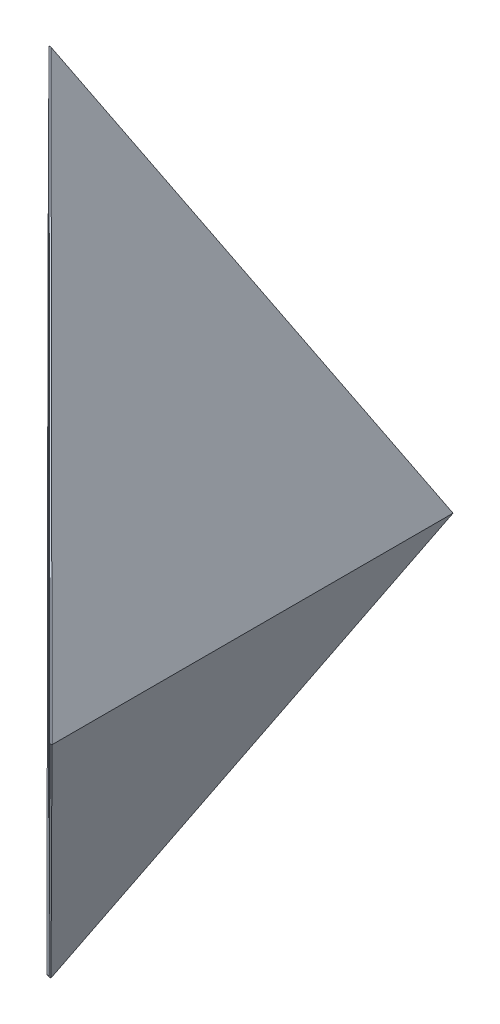
ISO-10303-21;
HEADER;
FILE_DESCRIPTION(('STEP AP214'),'2;1');
FILE_NAME('part.step','',(''),(''),'','','');
FILE_SCHEMA(('AUTOMOTIVE_DESIGN { 1 0 10303 214 1 1 1 1 }'));
ENDSEC;
DATA;
#1=APPLICATION_CONTEXT('core data for automotive mechanical design processes');
#2=APPLICATION_PROTOCOL_DEFINITION('international standard','automotive_design',2000,#1);
#3=PRODUCT_CONTEXT('',#1,'mechanical');
#4=PRODUCT('Part','Part','',(#3));
#5=PRODUCT_RELATED_PRODUCT_CATEGORY('part','',(#4));
#6=PRODUCT_DEFINITION_FORMATION('','',#4);
#7=PRODUCT_DEFINITION_CONTEXT('part definition',#1,'design');
#8=PRODUCT_DEFINITION('design','',#6,#7);
#9=PRODUCT_DEFINITION_SHAPE('','',#8);
#10=(LENGTH_UNIT() NAMED_UNIT(*) SI_UNIT(.MILLI.,.METRE.));
#11=(NAMED_UNIT(*) PLANE_ANGLE_UNIT() SI_UNIT($,.RADIAN.));
#12=(NAMED_UNIT(*) SI_UNIT($,.STERADIAN.) SOLID_ANGLE_UNIT());
#13=UNCERTAINTY_MEASURE_WITH_UNIT(LENGTH_MEASURE(1.E-05),#10,'distance_accuracy_value','');
#14=(GEOMETRIC_REPRESENTATION_CONTEXT(3) GLOBAL_UNCERTAINTY_ASSIGNED_CONTEXT((#13)) GLOBAL_UNIT_ASSIGNED_CONTEXT((#10,
#11,#12)) REPRESENTATION_CONTEXT('',''));
#15=CARTESIAN_POINT('',(0.,0.,0.));
#16=DIRECTION('',(0.,0.,1.));
#17=DIRECTION('',(1.,0.,0.));
#18=AXIS2_PLACEMENT_3D('',#15,#16,#17);
#19=CARTESIAN_POINT('',(-8.,-4.,20.));
#20=DIRECTION('',(0.894427190999916,0.447213595499958,0.));
#21=DIRECTION('',(-0.447213595499958,0.894427190999916,0.));
#22=AXIS2_PLACEMENT_3D('',#19,#20,#21);
#23=PLANE('',#22);
#24=DIRECTION('',(-0.40858977585186,0.817179551703719,0.40653656089783));
#25=VECTOR('',#24,1.);
#26=CARTESIAN_POINT('',(-8.34715461892255,-3.30569076215489,18.2554603746064));
#27=LINE('',#26,#25);
#28=CARTESIAN_POINT('',(-0.0500000000000014,-19.9,10.));
#29=VERTEX_POINT('',#28);
#30=CARTESIAN_POINT('',(-0.100251249904831,-19.7994975001903,10.0499987310611));
#31=VERTEX_POINT('',#30);
#32=EDGE_CURVE('E42',#29,#31,#27,.T.);
#33=ORIENTED_EDGE('',*,*,#32,.T.);
#34=DIRECTION('',(-0.407902483611627,0.815804967223254,-0.409972949494637));
#35=VECTOR('',#34,1.);
#36=CARTESIAN_POINT('',(-5.00829885081698,-9.98340229836604,5.11703844753937));
#37=LINE('',#36,#35);
#38=CARTESIAN_POINT('',(-10.,0.,0.100000000000002));
#39=VERTEX_POINT('',#38);
#40=EDGE_CURVE('E81',#31,#39,#37,.T.);
#41=ORIENTED_EDGE('',*,*,#40,.T.);
#42=DIRECTION('',(0.40858977585186,-0.817179551703719,0.40653656089783));
#43=VECTOR('',#42,1.);
#44=CARTESIAN_POINT('',(-5.02502097306595,-9.94995805386811,5.04997913232635));
#45=LINE('',#44,#43);
#46=EDGE_CURVE('E98',#39,#29,#45,.T.);
#47=ORIENTED_EDGE('',*,*,#46,.T.);
#48=EDGE_LOOP('',(#33,#41,#47));
#49=FACE_BOUND('',#48,.T.);
#50=ADVANCED_FACE('F34',(#49),#23,.F.);
#51=CARTESIAN_POINT('',(10.,0.,0.1));
#52=DIRECTION('',(0.,-0.445413041592115,0.895325204816474));
#53=DIRECTION('',(0.,-0.895325204816474,-0.445413041592115));
#54=AXIS2_PLACEMENT_3D('',#51,#52,#53);
#55=PLANE('',#54);
#56=DIRECTION('',(-1.,0.,0.));
#57=VECTOR('',#56,1.);
#58=CARTESIAN_POINT('',(10.,0.,0.1));
#59=LINE('',#58,#57);
#60=CARTESIAN_POINT('',(10.,0.,0.1));
#61=VERTEX_POINT('',#60);
#62=EDGE_CURVE('E100',#61,#39,#59,.T.);
#63=ORIENTED_EDGE('',*,*,#62,.T.);
#64=DIRECTION('',(-0.40858977585186,-0.817179551703719,-0.40653656089783));
#65=VECTOR('',#64,1.);
#66=CARTESIAN_POINT('',(-5.02502097306595,9.94995805386811,5.04997913232634));
#67=LINE('',#66,#65);
#68=CARTESIAN_POINT('',(-0.0500000000000049,19.9,10.));
#69=VERTEX_POINT('',#68);
#70=EDGE_CURVE('E11',#69,#39,#67,.T.);
#71=ORIENTED_EDGE('',*,*,#70,.F.);
#72=DIRECTION('',(-1.,0.,0.));
#73=VECTOR('',#72,1.);
#74=CARTESIAN_POINT('',(10.,19.9,10.));
#75=LINE('',#74,#73);
#76=CARTESIAN_POINT('',(0.0500000000000006,19.9,10.));
#77=VERTEX_POINT('',#76);
#78=EDGE_CURVE('E118',#77,#69,#75,.T.);
#79=ORIENTED_EDGE('',*,*,#78,.F.);
#80=DIRECTION('',(-0.40858977585186,0.817179551703719,0.40653656089783));
#81=VECTOR('',#80,1.);
#82=CARTESIAN_POINT('',(5.02502097306595,9.94995805386811,5.04997913232634));
#83=LINE('',#82,#81);
#84=EDGE_CURVE('E112',#61,#77,#83,.T.);
#85=ORIENTED_EDGE('',*,*,#84,.F.);
#86=EDGE_LOOP('',(#63,#71,#79,#85));
#87=FACE_BOUND('',#86,.T.);
#88=ADVANCED_FACE('F110',(#87),#55,.F.);
#89=CARTESIAN_POINT('',(10.,19.9,10.));
#90=DIRECTION('',(0.,-0.445413041592115,-0.895325204816474));
#91=DIRECTION('',(0.,0.895325204816474,-0.445413041592115));
#92=AXIS2_PLACEMENT_3D('',#89,#90,#91);
#93=PLANE('',#92);
#94=ORIENTED_EDGE('',*,*,#78,.T.);
#95=DIRECTION('',(0.40858977585186,-0.817179551703719,0.40653656089783));
#96=VECTOR('',#95,1.);
#97=CARTESIAN_POINT('',(1.62780332955326,16.5443933408935,11.6693721570429));
#98=LINE('',#97,#96);
#99=CARTESIAN_POINT('',(9.9,0.,19.9));
#100=VERTEX_POINT('',#99);
#101=EDGE_CURVE('E89',#69,#100,#98,.T.);
#102=ORIENTED_EDGE('',*,*,#101,.T.);
#103=DIRECTION('',(-1.,0.,0.));
#104=VECTOR('',#103,1.);
#105=CARTESIAN_POINT('',(10.,0.,19.9));
#106=LINE('',#105,#104);
#107=CARTESIAN_POINT('',(10.,0.,19.9));
#108=VERTEX_POINT('',#107);
#109=EDGE_CURVE('E56',#108,#100,#106,.T.);
#110=ORIENTED_EDGE('',*,*,#109,.F.);
#111=DIRECTION('',(0.40858977585186,-0.817179551703719,0.40653656089783));
#112=VECTOR('',#111,1.);
#113=CARTESIAN_POINT('',(8.34715461892255,3.30569076215489,18.2554603746064));
#114=LINE('',#113,#112);
#115=EDGE_CURVE('E125',#77,#108,#114,.T.);
#116=ORIENTED_EDGE('',*,*,#115,.F.);
#117=EDGE_LOOP('',(#94,#102,#110,#116));
#118=FACE_BOUND('',#117,.T.);
#119=ADVANCED_FACE('F138',(#118),#93,.F.);
#120=CARTESIAN_POINT('',(10.,0.,19.9));
#121=DIRECTION('',(0.,0.445413041592115,-0.895325204816474));
#122=DIRECTION('',(0.,0.895325204816474,0.445413041592115));
#123=AXIS2_PLACEMENT_3D('',#120,#121,#122);
#124=PLANE('',#123);
#125=DIRECTION('',(-0.40858977585186,-0.817179551703719,-0.40653656089783));
#126=VECTOR('',#125,1.);
#127=CARTESIAN_POINT('',(9.91669456049306,0.0333891209861348,19.9166106682293));
#128=LINE('',#127,#126);
#129=CARTESIAN_POINT('',(-0.0249373449445607,-19.8498746898891,10.0249367120652));
#130=VERTEX_POINT('',#129);
#131=EDGE_CURVE('E85',#100,#130,#128,.T.);
#132=ORIENTED_EDGE('',*,*,#131,.T.);
#133=DIRECTION('',(-0.801114281716517,0.535862350541028,0.266584787455085));
#134=VECTOR('',#133,1.);
#135=CARTESIAN_POINT('',(-4.22135154089798,-17.0429089095898,11.4213669243749));
#136=LINE('',#135,#134);
#137=EDGE_CURVE('E83',#130,#31,#136,.T.);
#138=ORIENTED_EDGE('',*,*,#137,.T.);
#139=ORIENTED_EDGE('',*,*,#32,.F.);
#140=DIRECTION('',(-1.,0.,0.));
#141=VECTOR('',#140,1.);
#142=CARTESIAN_POINT('',(10.,-19.9,10.));
#143=LINE('',#142,#141);
#144=CARTESIAN_POINT('',(0.050000000000004,-19.9,10.));
#145=VERTEX_POINT('',#144);
#146=EDGE_CURVE('E107',#145,#29,#143,.T.);
#147=ORIENTED_EDGE('',*,*,#146,.F.);
#148=DIRECTION('',(-0.40858977585186,-0.817179551703719,-0.40653656089783));
#149=VECTOR('',#148,1.);
#150=CARTESIAN_POINT('',(8.34715461892255,-3.30569076215489,18.2554603746064));
#151=LINE('',#150,#149);
#152=EDGE_CURVE('E122',#108,#145,#151,.T.);
#153=ORIENTED_EDGE('',*,*,#152,.F.);
#154=ORIENTED_EDGE('',*,*,#109,.T.);
#155=EDGE_LOOP('',(#132,#138,#139,#147,#153,#154));
#156=FACE_BOUND('',#155,.T.);
#157=ADVANCED_FACE('F135',(#156),#124,.F.);
#158=CARTESIAN_POINT('',(10.,-19.9,10.));
#159=DIRECTION('',(0.,0.445413041592115,0.895325204816474));
#160=DIRECTION('',(0.,-0.895325204816474,0.445413041592115));
#161=AXIS2_PLACEMENT_3D('',#158,#159,#160);
#162=PLANE('',#161);
#163=ORIENTED_EDGE('',*,*,#146,.T.);
#164=ORIENTED_EDGE('',*,*,#46,.F.);
#165=ORIENTED_EDGE('',*,*,#62,.F.);
#166=DIRECTION('',(0.40858977585186,0.817179551703719,-0.40653656089783));
#167=VECTOR('',#166,1.);
#168=CARTESIAN_POINT('',(5.02502097306595,-9.94995805386811,5.04997913232635));
#169=LINE('',#168,#167);
#170=EDGE_CURVE('E120',#145,#61,#169,.T.);
#171=ORIENTED_EDGE('',*,*,#170,.F.);
#172=EDGE_LOOP('',(#163,#164,#165,#171));
#173=FACE_BOUND('',#172,.T.);
#174=ADVANCED_FACE('F104',(#173),#162,.F.);
#175=CARTESIAN_POINT('',(8.,-4.,20.));
#176=DIRECTION('',(-0.894427190999916,0.447213595499958,0.));
#177=DIRECTION('',(-0.447213595499958,-0.894427190999916,0.));
#178=AXIS2_PLACEMENT_3D('',#175,#176,#177);
#179=PLANE('',#178);
#180=DIRECTION('',(0.,0.,-1.));
#181=VECTOR('',#180,1.);
#182=CARTESIAN_POINT('',(10.,0.,20.));
#183=LINE('',#182,#181);
#184=EDGE_CURVE('E108',#108,#61,#183,.T.);
#185=ORIENTED_EDGE('',*,*,#184,.F.);
#186=ORIENTED_EDGE('',*,*,#152,.T.);
#187=ORIENTED_EDGE('',*,*,#170,.T.);
#188=EDGE_LOOP('',(#185,#186,#187));
#189=FACE_BOUND('',#188,.T.);
#190=ADVANCED_FACE('F36',(#189),#179,.F.);
#191=CARTESIAN_POINT('',(8.,4.,20.));
#192=DIRECTION('',(-0.894427190999916,-0.447213595499958,0.));
#193=DIRECTION('',(0.447213595499958,-0.894427190999916,0.));
#194=AXIS2_PLACEMENT_3D('',#191,#192,#193);
#195=PLANE('',#194);
#196=ORIENTED_EDGE('',*,*,#184,.T.);
#197=ORIENTED_EDGE('',*,*,#84,.T.);
#198=ORIENTED_EDGE('',*,*,#115,.T.);
#199=EDGE_LOOP('',(#196,#197,#198));
#200=FACE_BOUND('',#199,.T.);
#201=ADVANCED_FACE('F132',(#200),#195,.F.);
#202=CARTESIAN_POINT('',(-28.2126848413598,-19.9,38.4054256738919));
#203=DIRECTION('',(-0.578314907530183,-0.578322209301699,-0.575408802467218));
#204=DIRECTION('',(0.707111245089513,-0.707102317255402,0.));
#205=AXIS2_PLACEMENT_3D('',#202,#203,#204);
#206=PLANE('',#205);
#207=ORIENTED_EDGE('',*,*,#137,.F.);
#208=DIRECTION('',(-0.409964319708693,0.815808447019521,-0.407904197499102));
#209=VECTOR('',#208,1.);
#210=CARTESIAN_POINT('',(0.000251887570586196,-19.9,10.0499993655225));
#211=LINE('',#210,#209);
#212=EDGE_CURVE('E48',#130,#39,#211,.T.);
#213=ORIENTED_EDGE('',*,*,#212,.T.);
#214=ORIENTED_EDGE('',*,*,#40,.F.);
#215=EDGE_LOOP('',(#207,#213,#214));
#216=FACE_BOUND('',#215,.T.);
#217=ADVANCED_FACE('F79',(#216),#206,.F.);
#218=CARTESIAN_POINT('',(-5.02481060846393,0.,5.05018843981981));
#219=DIRECTION('',(0.70532341822326,0.,-0.708885657709236));
#220=DIRECTION('',(-0.708885657709236,0.,-0.70532341822326));
#221=AXIS2_PLACEMENT_3D('',#218,#219,#220);
#222=PLANE('',#221);
#223=ORIENTED_EDGE('',*,*,#70,.T.);
#224=ORIENTED_EDGE('',*,*,#212,.F.);
#225=ORIENTED_EDGE('',*,*,#131,.F.);
#226=ORIENTED_EDGE('',*,*,#101,.F.);
#227=EDGE_LOOP('',(#223,#224,#225,#226));
#228=FACE_BOUND('',#227,.T.);
#229=ADVANCED_FACE('F88',(#228),#222,.F.);
#230=CLOSED_SHELL('',(#50,#88,#119,#157,#174,#190,#201,#217,#229));
#231=MANIFOLD_SOLID_BREP('B2',#230);
#232=ADVANCED_BREP_SHAPE_REPRESENTATION('',(#18,#231),#14);
#233=SHAPE_DEFINITION_REPRESENTATION(#9,#232);
ENDSEC;
END-ISO-10303-21;
